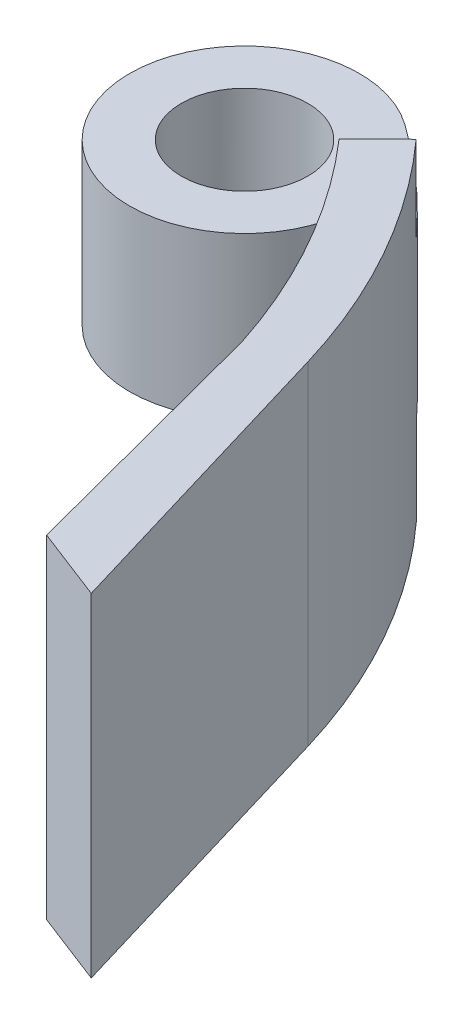
ISO-10303-21;
HEADER;
FILE_DESCRIPTION(('STEP AP214'),'2;1');
FILE_NAME('part.step','',(''),(''),'','','');
FILE_SCHEMA(('AUTOMOTIVE_DESIGN { 1 0 10303 214 1 1 1 1 }'));
ENDSEC;
DATA;
#1=APPLICATION_CONTEXT('core data for automotive mechanical design processes');
#2=APPLICATION_PROTOCOL_DEFINITION('international standard','automotive_design',2000,#1);
#3=PRODUCT_CONTEXT('',#1,'mechanical');
#4=PRODUCT('Part','Part','',(#3));
#5=PRODUCT_RELATED_PRODUCT_CATEGORY('part','',(#4));
#6=PRODUCT_DEFINITION_FORMATION('','',#4);
#7=PRODUCT_DEFINITION_CONTEXT('part definition',#1,'design');
#8=PRODUCT_DEFINITION('design','',#6,#7);
#9=PRODUCT_DEFINITION_SHAPE('','',#8);
#10=(LENGTH_UNIT() NAMED_UNIT(*) SI_UNIT(.MILLI.,.METRE.));
#11=(NAMED_UNIT(*) PLANE_ANGLE_UNIT() SI_UNIT($,.RADIAN.));
#12=(NAMED_UNIT(*) SI_UNIT($,.STERADIAN.) SOLID_ANGLE_UNIT());
#13=UNCERTAINTY_MEASURE_WITH_UNIT(LENGTH_MEASURE(1.E-05),#10,'distance_accuracy_value','');
#14=(GEOMETRIC_REPRESENTATION_CONTEXT(3) GLOBAL_UNCERTAINTY_ASSIGNED_CONTEXT((#13)) GLOBAL_UNIT_ASSIGNED_CONTEXT((#10,
#11,#12)) REPRESENTATION_CONTEXT('',''));
#15=CARTESIAN_POINT('',(0.,0.,0.));
#16=DIRECTION('',(0.,0.,1.));
#17=DIRECTION('',(1.,0.,0.));
#18=AXIS2_PLACEMENT_3D('',#15,#16,#17);
#19=CARTESIAN_POINT('',(23.0206722128998,29.,-62.7690123091901));
#20=DIRECTION('',(0.,-1.,0.));
#21=DIRECTION('',(0.,0.,-1.));
#22=AXIS2_PLACEMENT_3D('',#19,#20,#21);
#23=CYLINDRICAL_SURFACE('',#22,10.);
#24=CARTESIAN_POINT('',(23.0206722128998,21.5,-62.7690123091901));
#25=DIRECTION('',(0.,1.,0.));
#26=DIRECTION('',(0.,0.,1.));
#27=AXIS2_PLACEMENT_3D('',#24,#25,#26);
#28=CIRCLE('',#27,10.);
#29=CARTESIAN_POINT('',(28.818508763389,21.5,-70.9167169757703));
#30=VERTEX_POINT('',#29);
#31=CARTESIAN_POINT('',(32.9081332083161,21.5,-61.2729791998901));
#32=VERTEX_POINT('',#31);
#33=EDGE_CURVE('E250',#30,#32,#28,.T.);
#34=ORIENTED_EDGE('',*,*,#33,.F.);
#35=DIRECTION('',(0.,-1.,0.));
#36=VECTOR('',#35,1.);
#37=CARTESIAN_POINT('',(28.818508763389,29.,-70.9167169757702));
#38=LINE('',#37,#36);
#39=CARTESIAN_POINT('',(28.818508763389,7.5,-70.9167169757703));
#40=VERTEX_POINT('',#39);
#41=EDGE_CURVE('E191',#30,#40,#38,.T.);
#42=ORIENTED_EDGE('',*,*,#41,.T.);
#43=CARTESIAN_POINT('',(23.0206722128998,7.5,-62.7690123091901));
#44=DIRECTION('',(0.,-1.,0.));
#45=DIRECTION('',(0.,0.,-1.));
#46=AXIS2_PLACEMENT_3D('',#43,#44,#45);
#47=CIRCLE('',#46,10.);
#48=CARTESIAN_POINT('',(32.9081332083161,7.5,-61.2729791998901));
#49=VERTEX_POINT('',#48);
#50=EDGE_CURVE('E226',#49,#40,#47,.T.);
#51=ORIENTED_EDGE('',*,*,#50,.F.);
#52=DIRECTION('',(0.,-1.,0.));
#53=VECTOR('',#52,1.);
#54=CARTESIAN_POINT('',(32.9081332083161,29.,-61.2729791998901));
#55=LINE('',#54,#53);
#56=EDGE_CURVE('E180',#32,#49,#55,.T.);
#57=ORIENTED_EDGE('',*,*,#56,.F.);
#58=EDGE_LOOP('',(#34,#42,#51,#57));
#59=FACE_BOUND('',#58,.T.);
#60=ADVANCED_FACE('F36',(#59),#23,.T.);
#61=CARTESIAN_POINT('',(23.0206722128998,29.,-62.7690123091901));
#62=DIRECTION('',(0.,-1.,0.));
#63=DIRECTION('',(0.,0.,-1.));
#64=AXIS2_PLACEMENT_3D('',#61,#62,#63);
#65=CYLINDRICAL_SURFACE('',#64,5.50000000000001);
#66=CARTESIAN_POINT('',(23.0206722128998,7.5,-62.7690123091901));
#67=DIRECTION('',(0.,-1.,0.));
#68=DIRECTION('',(0.,0.,-1.));
#69=AXIS2_PLACEMENT_3D('',#66,#67,#68);
#70=CIRCLE('',#69,5.50000000000001);
#71=CARTESIAN_POINT('',(23.0206722128998,7.5,-68.2690123091901));
#72=VERTEX_POINT('',#71);
#73=EDGE_CURVE('E209',#72,#72,#70,.T.);
#74=ORIENTED_EDGE('',*,*,#73,.T.);
#75=EDGE_LOOP('',(#74));
#76=FACE_BOUND('',#75,.T.);
#77=CARTESIAN_POINT('',(23.0206722128998,21.5,-62.7690123091901));
#78=DIRECTION('',(0.,1.,0.));
#79=DIRECTION('',(0.,0.,1.));
#80=AXIS2_PLACEMENT_3D('',#77,#78,#79);
#81=CIRCLE('',#80,5.50000000000001);
#82=CARTESIAN_POINT('',(23.0206722128998,21.5,-57.2690123091901));
#83=VERTEX_POINT('',#82);
#84=EDGE_CURVE('E244',#83,#83,#81,.T.);
#85=ORIENTED_EDGE('',*,*,#84,.T.);
#86=EDGE_LOOP('',(#85));
#87=FACE_BOUND('',#86,.T.);
#88=ADVANCED_FACE('F38',(#76,#87),#65,.F.);
#89=CARTESIAN_POINT('',(-7.61734022617568,29.,-22.6247450499297));
#90=DIRECTION('',(0.,-1.,0.));
#91=DIRECTION('',(0.,0.,-1.));
#92=AXIS2_PLACEMENT_3D('',#89,#90,#91);
#93=CYLINDRICAL_SURFACE('',#92,55.9999999999987);
#94=DIRECTION('',(0.,-1.,0.));
#95=VECTOR('',#94,1.);
#96=CARTESIAN_POINT('',(34.5803688752672,29.,-59.4398689338699));
#97=LINE('',#96,#95);
#98=CARTESIAN_POINT('',(34.5803688752672,21.5,-59.4398689338699));
#99=VERTEX_POINT('',#98);
#100=CARTESIAN_POINT('',(34.5803688752672,29.,-59.4398689338699));
#101=VERTEX_POINT('',#100);
#102=EDGE_CURVE('E252',#99,#101,#97,.F.);
#103=ORIENTED_EDGE('',*,*,#102,.F.);
#104=CARTESIAN_POINT('',(-7.61734022617568,21.5,-22.6247450499297));
#105=DIRECTION('',(0.,1.,0.));
#106=DIRECTION('',(0.,0.,1.));
#107=AXIS2_PLACEMENT_3D('',#104,#105,#106);
#108=CIRCLE('',#107,55.9999999999987);
#109=EDGE_CURVE('E247',#99,#32,#108,.T.);
#110=ORIENTED_EDGE('',*,*,#109,.T.);
#111=ORIENTED_EDGE('',*,*,#56,.T.);
#112=CARTESIAN_POINT('',(-7.61734022617568,7.5,-22.6247450499297));
#113=DIRECTION('',(0.,-1.,0.));
#114=DIRECTION('',(0.,0.,-1.));
#115=AXIS2_PLACEMENT_3D('',#112,#113,#114);
#116=CIRCLE('',#115,55.9999999999987);
#117=CARTESIAN_POINT('',(34.5572435419437,7.5,-59.4663585323186));
#118=VERTEX_POINT('',#117);
#119=EDGE_CURVE('E223',#49,#118,#116,.T.);
#120=ORIENTED_EDGE('',*,*,#119,.T.);
#121=DIRECTION('',(0.,1.,0.));
#122=VECTOR('',#121,1.);
#123=CARTESIAN_POINT('',(34.5572435419437,3.75,-59.4663585323187));
#124=LINE('',#123,#122);
#125=CARTESIAN_POINT('',(34.5572435419437,0.,-59.4663585323187));
#126=VERTEX_POINT('',#125);
#127=EDGE_CURVE('E231',#118,#126,#124,.F.);
#128=ORIENTED_EDGE('',*,*,#127,.T.);
#129=CARTESIAN_POINT('',(-7.61734022617568,0.,-22.6247450499297));
#130=DIRECTION('',(0.,1.,0.));
#131=DIRECTION('',(0.,0.,1.));
#132=AXIS2_PLACEMENT_3D('',#129,#130,#131);
#133=CIRCLE('',#132,55.9999999999987);
#134=CARTESIAN_POINT('',(45.618872447791,0.,-40.0001777102133));
#135=VERTEX_POINT('',#134);
#136=EDGE_CURVE('E206',#135,#126,#133,.T.);
#137=ORIENTED_EDGE('',*,*,#136,.F.);
#138=DIRECTION('',(0.,-1.,0.));
#139=VECTOR('',#138,1.);
#140=CARTESIAN_POINT('',(45.618872447791,29.,-40.0001777102133));
#141=LINE('',#140,#139);
#142=CARTESIAN_POINT('',(45.618872447791,29.,-40.0001777102133));
#143=VERTEX_POINT('',#142);
#144=EDGE_CURVE('E182',#143,#135,#141,.T.);
#145=ORIENTED_EDGE('',*,*,#144,.F.);
#146=CARTESIAN_POINT('',(-7.61734022617568,29.,-22.6247450499297));
#147=DIRECTION('',(0.,1.,0.));
#148=DIRECTION('',(0.,0.,1.));
#149=AXIS2_PLACEMENT_3D('',#146,#147,#148);
#150=CIRCLE('',#149,55.9999999999987);
#151=EDGE_CURVE('E197',#143,#101,#150,.T.);
#152=ORIENTED_EDGE('',*,*,#151,.T.);
#153=EDGE_LOOP('',(#103,#110,#111,#120,#128,#137,#145,#152));
#154=FACE_BOUND('',#153,.T.);
#155=ADVANCED_FACE('F291',(#154),#93,.F.);
#156=CARTESIAN_POINT('',(-3.64937591935032,29.,-25.2895708429214));
#157=DIRECTION('',(0.,-1.,0.));
#158=DIRECTION('',(0.,0.,-1.));
#159=AXIS2_PLACEMENT_3D('',#156,#157,#158);
#160=CYLINDRICAL_SURFACE('',#159,56.);
#161=CARTESIAN_POINT('',(-3.64937591935032,21.5,-25.2895708429214));
#162=DIRECTION('',(0.,1.,0.));
#163=DIRECTION('',(0.,0.,1.));
#164=AXIS2_PLACEMENT_3D('',#161,#162,#163);
#165=CIRCLE('',#164,56.);
#166=CARTESIAN_POINT('',(37.9537137343731,21.5,-62.7753405597654));
#167=VERTEX_POINT('',#166);
#168=EDGE_CURVE('E170',#167,#30,#165,.T.);
#169=ORIENTED_EDGE('',*,*,#168,.F.);
#170=DIRECTION('',(0.,-1.,0.));
#171=VECTOR('',#170,1.);
#172=CARTESIAN_POINT('',(37.9537137343731,29.,-62.7753405597654));
#173=LINE('',#172,#171);
#174=CARTESIAN_POINT('',(37.9537137343731,29.,-62.7753405597654));
#175=VERTEX_POINT('',#174);
#176=EDGE_CURVE('E254',#167,#175,#173,.F.);
#177=ORIENTED_EDGE('',*,*,#176,.T.);
#178=CARTESIAN_POINT('',(-3.64937591935032,29.,-25.2895708429214));
#179=DIRECTION('',(0.,1.,0.));
#180=DIRECTION('',(0.,0.,1.));
#181=AXIS2_PLACEMENT_3D('',#178,#179,#180);
#182=CIRCLE('',#181,56.);
#183=CARTESIAN_POINT('',(50.0097940460506,29.,-41.3112273934852));
#184=VERTEX_POINT('',#183);
#185=EDGE_CURVE('E193',#184,#175,#182,.T.);
#186=ORIENTED_EDGE('',*,*,#185,.F.);
#187=DIRECTION('',(0.,-1.,0.));
#188=VECTOR('',#187,1.);
#189=CARTESIAN_POINT('',(50.0097940460506,29.,-41.3112273934852));
#190=LINE('',#189,#188);
#191=CARTESIAN_POINT('',(50.0097940460506,0.,-41.3112273934852));
#192=VERTEX_POINT('',#191);
#193=EDGE_CURVE('E189',#184,#192,#190,.T.);
#194=ORIENTED_EDGE('',*,*,#193,.T.);
#195=CARTESIAN_POINT('',(-3.64937591935032,0.,-25.2895708429214));
#196=DIRECTION('',(0.,1.,0.));
#197=DIRECTION('',(0.,0.,1.));
#198=AXIS2_PLACEMENT_3D('',#195,#196,#197);
#199=CIRCLE('',#198,56.);
#200=CARTESIAN_POINT('',(37.8088421101298,0.,-62.9355023338554));
#201=VERTEX_POINT('',#200);
#202=EDGE_CURVE('E194',#192,#201,#199,.T.);
#203=ORIENTED_EDGE('',*,*,#202,.T.);
#204=DIRECTION('',(0.,-1.,0.));
#205=VECTOR('',#204,1.);
#206=CARTESIAN_POINT('',(37.8088421101298,29.,-62.9355023338554));
#207=LINE('',#206,#205);
#208=CARTESIAN_POINT('',(37.8088421101298,7.5,-62.9355023338554));
#209=VERTEX_POINT('',#208);
#210=EDGE_CURVE('E229',#209,#201,#207,.T.);
#211=ORIENTED_EDGE('',*,*,#210,.F.);
#212=CARTESIAN_POINT('',(-3.64937591935032,7.5,-25.2895708429214));
#213=DIRECTION('',(0.,-1.,0.));
#214=DIRECTION('',(0.,0.,-1.));
#215=AXIS2_PLACEMENT_3D('',#212,#213,#214);
#216=CIRCLE('',#215,56.);
#217=EDGE_CURVE('E175',#40,#209,#216,.T.);
#218=ORIENTED_EDGE('',*,*,#217,.F.);
#219=ORIENTED_EDGE('',*,*,#41,.F.);
#220=EDGE_LOOP('',(#169,#177,#186,#194,#203,#211,#218,#219));
#221=FACE_BOUND('',#220,.T.);
#222=ADVANCED_FACE('F303',(#221),#160,.T.);
#223=CARTESIAN_POINT('',(0.,0.,0.));
#224=DIRECTION('',(0.,1.,0.));
#225=DIRECTION('',(0.,0.,1.));
#226=AXIS2_PLACEMENT_3D('',#223,#224,#225);
#227=PLANE('',#226);
#228=DIRECTION('',(-0.695407063160365,0.,0.718616042477953));
#229=VECTOR('',#228,1.);
#230=CARTESIAN_POINT('',(-11.9259738819197,0.,-11.5408034086679));
#231=LINE('',#230,#229);
#232=CARTESIAN_POINT('',(34.6000094366955,0.,-59.6195759377705));
#233=VERTEX_POINT('',#232);
#234=EDGE_CURVE('E177',#201,#233,#231,.T.);
#235=ORIENTED_EDGE('',*,*,#234,.F.);
#236=ORIENTED_EDGE('',*,*,#202,.F.);
#237=DIRECTION('',(0.286101009831496,0.,0.958199463667872));
#238=VECTOR('',#237,1.);
#239=CARTESIAN_POINT('',(57.2414386246392,0.,-17.0912571084399));
#240=LINE('',#239,#238);
#241=CARTESIAN_POINT('',(58.0453486153183,0.,-14.3988299745418));
#242=VERTEX_POINT('',#241);
#243=EDGE_CURVE('E198',#192,#242,#240,.T.);
#244=ORIENTED_EDGE('',*,*,#243,.T.);
#245=DIRECTION('',(0.932682556359361,0.,0.360698279817035));
#246=VECTOR('',#245,1.);
#247=CARTESIAN_POINT('',(12.3958995405945,0.,-32.0529370912444));
#248=LINE('',#247,#246);
#249=CARTESIAN_POINT('',(51.7108084269692,0.,-16.8485999780552));
#250=VERTEX_POINT('',#249);
#251=EDGE_CURVE('E201',#250,#242,#248,.T.);
#252=ORIENTED_EDGE('',*,*,#251,.F.);
#253=DIRECTION('',(0.254470465885758,0.,0.967080545762288));
#254=VECTOR('',#253,1.);
#255=CARTESIAN_POINT('',(52.5085936316344,0.,-13.816725342061));
#256=LINE('',#255,#254);
#257=EDGE_CURVE('E204',#135,#250,#256,.T.);
#258=ORIENTED_EDGE('',*,*,#257,.F.);
#259=ORIENTED_EDGE('',*,*,#136,.T.);
#260=CARTESIAN_POINT('',(23.0206722128998,0.,-62.7690123091901));
#261=DIRECTION('',(0.,-1.,0.));
#262=DIRECTION('',(0.,0.,-1.));
#263=AXIS2_PLACEMENT_3D('',#260,#261,#262);
#264=CIRCLE('',#263,12.);
#265=EDGE_CURVE('E237',#233,#126,#264,.T.);
#266=ORIENTED_EDGE('',*,*,#265,.F.);
#267=EDGE_LOOP('',(#235,#236,#244,#252,#258,#259,#266));
#268=FACE_BOUND('',#267,.T.);
#269=ADVANCED_FACE('F267',(#268),#227,.F.);
#270=CARTESIAN_POINT('',(52.5085936316344,29.,-13.816725342061));
#271=DIRECTION('',(0.967080545762288,0.,-0.254470465885758));
#272=DIRECTION('',(-0.254470465885758,0.,-0.967080545762288));
#273=AXIS2_PLACEMENT_3D('',#270,#271,#272);
#274=PLANE('',#273);
#275=DIRECTION('',(0.254470465885758,0.,0.967080545762288));
#276=VECTOR('',#275,1.);
#277=CARTESIAN_POINT('',(52.5085936316344,13.5,-13.816725342061));
#278=LINE('',#277,#276);
#279=CARTESIAN_POINT('',(47.600223815655,13.5,-32.470320146935));
#280=VERTEX_POINT('',#279);
#281=CARTESIAN_POINT('',(48.1093326274519,13.5,-30.5355210501081));
#282=VERTEX_POINT('',#281);
#283=EDGE_CURVE('E44',#280,#282,#278,.T.);
#284=ORIENTED_EDGE('',*,*,#283,.F.);
#285=DIRECTION('',(0.,1.,0.));
#286=VECTOR('',#285,1.);
#287=CARTESIAN_POINT('',(47.600223815655,13.5,-32.470320146935));
#288=LINE('',#287,#286);
#289=CARTESIAN_POINT('',(47.600223815655,15.5,-32.470320146935));
#290=VERTEX_POINT('',#289);
#291=EDGE_CURVE('E11',#280,#290,#288,.T.);
#292=ORIENTED_EDGE('',*,*,#291,.T.);
#293=DIRECTION('',(0.254470465885758,0.,0.967080545762288));
#294=VECTOR('',#293,1.);
#295=CARTESIAN_POINT('',(52.5085936316344,15.5,-13.816725342061));
#296=LINE('',#295,#294);
#297=CARTESIAN_POINT('',(48.1093326274519,15.5,-30.5355210501081));
#298=VERTEX_POINT('',#297);
#299=EDGE_CURVE('E140',#290,#298,#296,.T.);
#300=ORIENTED_EDGE('',*,*,#299,.T.);
#301=DIRECTION('',(0.,1.,0.));
#302=VECTOR('',#301,1.);
#303=CARTESIAN_POINT('',(48.1093326274519,13.5,-30.5355210501081));
#304=LINE('',#303,#302);
#305=EDGE_CURVE('E144',#282,#298,#304,.T.);
#306=ORIENTED_EDGE('',*,*,#305,.F.);
#307=EDGE_LOOP('',(#284,#292,#300,#306));
#308=FACE_BOUND('',#307,.T.);
#309=CARTESIAN_POINT('',(49.1265431369703,15.5,-26.6697502571161));
#310=VERTEX_POINT('',#309);
#311=CARTESIAN_POINT('',(49.6356519487672,15.5,-24.7349511602892));
#312=VERTEX_POINT('',#311);
#313=EDGE_CURVE('E147',#310,#312,#296,.T.);
#314=ORIENTED_EDGE('',*,*,#313,.T.);
#315=DIRECTION('',(0.,1.,0.));
#316=VECTOR('',#315,1.);
#317=CARTESIAN_POINT('',(49.6356519487672,13.5,-24.7349511602892));
#318=LINE('',#317,#316);
#319=CARTESIAN_POINT('',(49.6356519487672,13.5,-24.7349511602892));
#320=VERTEX_POINT('',#319);
#321=EDGE_CURVE('E145',#312,#320,#318,.F.);
#322=ORIENTED_EDGE('',*,*,#321,.T.);
#323=CARTESIAN_POINT('',(49.1265431369703,13.5,-26.6697502571161));
#324=VERTEX_POINT('',#323);
#325=EDGE_CURVE('E163',#324,#320,#278,.T.);
#326=ORIENTED_EDGE('',*,*,#325,.F.);
#327=DIRECTION('',(0.,1.,0.));
#328=VECTOR('',#327,1.);
#329=CARTESIAN_POINT('',(49.1265431369703,13.5,-26.6697502571161));
#330=LINE('',#329,#328);
#331=EDGE_CURVE('E166',#310,#324,#330,.F.);
#332=ORIENTED_EDGE('',*,*,#331,.F.);
#333=EDGE_LOOP('',(#314,#322,#326,#332));
#334=FACE_BOUND('',#333,.T.);
#335=ORIENTED_EDGE('',*,*,#257,.T.);
#336=DIRECTION('',(0.,-1.,0.));
#337=VECTOR('',#336,1.);
#338=CARTESIAN_POINT('',(51.7108084269692,29.,-16.8485999780552));
#339=LINE('',#338,#337);
#340=CARTESIAN_POINT('',(51.7108084269692,29.,-16.8485999780552));
#341=VERTEX_POINT('',#340);
#342=EDGE_CURVE('E184',#341,#250,#339,.T.);
#343=ORIENTED_EDGE('',*,*,#342,.F.);
#344=DIRECTION('',(0.254470465885758,0.,0.967080545762288));
#345=VECTOR('',#344,1.);
#346=CARTESIAN_POINT('',(52.5085936316344,29.,-13.816725342061));
#347=LINE('',#346,#345);
#348=EDGE_CURVE('E217',#143,#341,#347,.T.);
#349=ORIENTED_EDGE('',*,*,#348,.F.);
#350=ORIENTED_EDGE('',*,*,#144,.T.);
#351=EDGE_LOOP('',(#335,#343,#349,#350));
#352=FACE_BOUND('',#351,.T.);
#353=ADVANCED_FACE('F157',(#308,#334,#352),#274,.F.);
#354=CARTESIAN_POINT('',(12.3958995405945,29.,-32.0529370912444));
#355=DIRECTION('',(0.360698279817035,0.,-0.932682556359361));
#356=DIRECTION('',(-0.932682556359361,0.,-0.360698279817035));
#357=AXIS2_PLACEMENT_3D('',#354,#355,#356);
#358=PLANE('',#357);
#359=ORIENTED_EDGE('',*,*,#251,.T.);
#360=DIRECTION('',(0.,-1.,0.));
#361=VECTOR('',#360,1.);
#362=CARTESIAN_POINT('',(58.0453486153183,29.,-14.3988299745418));
#363=LINE('',#362,#361);
#364=CARTESIAN_POINT('',(58.0453486153183,29.,-14.3988299745418));
#365=VERTEX_POINT('',#364);
#366=EDGE_CURVE('E187',#365,#242,#363,.T.);
#367=ORIENTED_EDGE('',*,*,#366,.F.);
#368=DIRECTION('',(0.932682556359361,0.,0.360698279817035));
#369=VECTOR('',#368,1.);
#370=CARTESIAN_POINT('',(12.3958995405945,29.,-32.0529370912444));
#371=LINE('',#370,#369);
#372=EDGE_CURVE('E215',#341,#365,#371,.T.);
#373=ORIENTED_EDGE('',*,*,#372,.F.);
#374=ORIENTED_EDGE('',*,*,#342,.T.);
#375=EDGE_LOOP('',(#359,#367,#373,#374));
#376=FACE_BOUND('',#375,.T.);
#377=ADVANCED_FACE('F266',(#376),#358,.F.);
#378=CARTESIAN_POINT('',(57.2414386246392,29.,-17.0912571084399));
#379=DIRECTION('',(0.958199463667872,0.,-0.286101009831496));
#380=DIRECTION('',(-0.286101009831496,0.,-0.958199463667872));
#381=AXIS2_PLACEMENT_3D('',#378,#379,#380);
#382=PLANE('',#381);
#383=ORIENTED_EDGE('',*,*,#243,.F.);
#384=ORIENTED_EDGE('',*,*,#193,.F.);
#385=DIRECTION('',(0.286101009831496,0.,0.958199463667872));
#386=VECTOR('',#385,1.);
#387=CARTESIAN_POINT('',(57.2414386246392,29.,-17.0912571084399));
#388=LINE('',#387,#386);
#389=EDGE_CURVE('E212',#184,#365,#388,.T.);
#390=ORIENTED_EDGE('',*,*,#389,.T.);
#391=ORIENTED_EDGE('',*,*,#366,.T.);
#392=EDGE_LOOP('',(#383,#384,#390,#391));
#393=FACE_BOUND('',#392,.T.);
#394=ADVANCED_FACE('F282',(#393),#382,.T.);
#395=CARTESIAN_POINT('',(0.,29.,0.));
#396=DIRECTION('',(0.,1.,0.));
#397=DIRECTION('',(0.,0.,1.));
#398=AXIS2_PLACEMENT_3D('',#395,#396,#397);
#399=PLANE('',#398);
#400=DIRECTION('',(0.7110872751399,0.,-0.703103752752119));
#401=VECTOR('',#400,1.);
#402=CARTESIAN_POINT('',(-12.623065866088,29.,-12.7663968162499));
#403=LINE('',#402,#401);
#404=EDGE_CURVE('E173',#101,#175,#403,.T.);
#405=ORIENTED_EDGE('',*,*,#404,.F.);
#406=ORIENTED_EDGE('',*,*,#151,.F.);
#407=ORIENTED_EDGE('',*,*,#348,.T.);
#408=ORIENTED_EDGE('',*,*,#372,.T.);
#409=ORIENTED_EDGE('',*,*,#389,.F.);
#410=ORIENTED_EDGE('',*,*,#185,.T.);
#411=EDGE_LOOP('',(#405,#406,#407,#408,#409,#410));
#412=FACE_BOUND('',#411,.T.);
#413=ADVANCED_FACE('F287',(#412),#399,.T.);
#414=CARTESIAN_POINT('',(-11.9259738819197,0.,-11.5408034086679));
#415=DIRECTION('',(-0.718616042477953,0.,-0.695407063160365));
#416=DIRECTION('',(-0.695407063160365,0.,0.718616042477953));
#417=AXIS2_PLACEMENT_3D('',#414,#415,#416);
#418=PLANE('',#417);
#419=ORIENTED_EDGE('',*,*,#210,.T.);
#420=ORIENTED_EDGE('',*,*,#234,.T.);
#421=DIRECTION('',(0.,1.,0.));
#422=VECTOR('',#421,1.);
#423=CARTESIAN_POINT('',(34.6000094366955,0.,-59.6195759377705));
#424=LINE('',#423,#422);
#425=CARTESIAN_POINT('',(34.6000094366955,7.5,-59.6195759377705));
#426=VERTEX_POINT('',#425);
#427=EDGE_CURVE('E234',#233,#426,#424,.T.);
#428=ORIENTED_EDGE('',*,*,#427,.T.);
#429=DIRECTION('',(-0.695407063160365,0.,0.718616042477953));
#430=VECTOR('',#429,1.);
#431=CARTESIAN_POINT('',(-11.9259738819197,7.5,-11.5408034086679));
#432=LINE('',#431,#430);
#433=EDGE_CURVE('E242',#209,#426,#432,.T.);
#434=ORIENTED_EDGE('',*,*,#433,.F.);
#435=EDGE_LOOP('',(#419,#420,#428,#434));
#436=FACE_BOUND('',#435,.T.);
#437=ADVANCED_FACE('F298',(#436),#418,.T.);
#438=CARTESIAN_POINT('',(23.0206722128998,0.,-62.7690123091901));
#439=DIRECTION('',(0.,1.,0.));
#440=DIRECTION('',(0.,0.,1.));
#441=AXIS2_PLACEMENT_3D('',#438,#439,#440);
#442=CYLINDRICAL_SURFACE('',#441,12.);
#443=CARTESIAN_POINT('',(23.0206722128998,7.5,-62.7690123091901));
#444=DIRECTION('',(0.,-1.,0.));
#445=DIRECTION('',(0.,0.,-1.));
#446=AXIS2_PLACEMENT_3D('',#443,#444,#445);
#447=CIRCLE('',#446,12.);
#448=EDGE_CURVE('E239',#426,#118,#447,.T.);
#449=ORIENTED_EDGE('',*,*,#448,.F.);
#450=ORIENTED_EDGE('',*,*,#427,.F.);
#451=ORIENTED_EDGE('',*,*,#265,.T.);
#452=ORIENTED_EDGE('',*,*,#127,.F.);
#453=EDGE_LOOP('',(#449,#450,#451,#452));
#454=FACE_BOUND('',#453,.T.);
#455=ADVANCED_FACE('F295',(#454),#442,.F.);
#456=CARTESIAN_POINT('',(0.,7.5,0.));
#457=DIRECTION('',(0.,-1.,0.));
#458=DIRECTION('',(0.,0.,-1.));
#459=AXIS2_PLACEMENT_3D('',#456,#457,#458);
#460=PLANE('',#459);
#461=ORIENTED_EDGE('',*,*,#73,.F.);
#462=EDGE_LOOP('',(#461));
#463=FACE_BOUND('',#462,.T.);
#464=ORIENTED_EDGE('',*,*,#50,.T.);
#465=ORIENTED_EDGE('',*,*,#217,.T.);
#466=ORIENTED_EDGE('',*,*,#433,.T.);
#467=ORIENTED_EDGE('',*,*,#448,.T.);
#468=ORIENTED_EDGE('',*,*,#119,.F.);
#469=EDGE_LOOP('',(#464,#465,#466,#467,#468));
#470=FACE_BOUND('',#469,.T.);
#471=ADVANCED_FACE('F316',(#463,#470),#460,.T.);
#472=CARTESIAN_POINT('',(-12.623065866088,29.,-12.7663968162499));
#473=DIRECTION('',(0.703103752752119,0.,0.7110872751399));
#474=DIRECTION('',(0.7110872751399,0.,-0.703103752752119));
#475=AXIS2_PLACEMENT_3D('',#472,#473,#474);
#476=PLANE('',#475);
#477=ORIENTED_EDGE('',*,*,#102,.T.);
#478=ORIENTED_EDGE('',*,*,#404,.T.);
#479=ORIENTED_EDGE('',*,*,#176,.F.);
#480=DIRECTION('',(-0.7110872751399,0.,0.703103752752119));
#481=VECTOR('',#480,1.);
#482=CARTESIAN_POINT('',(-12.623065866088,21.5,-12.7663968162499));
#483=LINE('',#482,#481);
#484=EDGE_CURVE('E257',#167,#99,#483,.T.);
#485=ORIENTED_EDGE('',*,*,#484,.T.);
#486=EDGE_LOOP('',(#477,#478,#479,#485));
#487=FACE_BOUND('',#486,.T.);
#488=ADVANCED_FACE('F307',(#487),#476,.F.);
#489=CARTESIAN_POINT('',(0.,21.5,0.));
#490=DIRECTION('',(0.,1.,0.));
#491=DIRECTION('',(0.,0.,1.));
#492=AXIS2_PLACEMENT_3D('',#489,#490,#491);
#493=PLANE('',#492);
#494=ORIENTED_EDGE('',*,*,#84,.F.);
#495=EDGE_LOOP('',(#494));
#496=FACE_BOUND('',#495,.T.);
#497=ORIENTED_EDGE('',*,*,#484,.F.);
#498=ORIENTED_EDGE('',*,*,#168,.T.);
#499=ORIENTED_EDGE('',*,*,#33,.T.);
#500=ORIENTED_EDGE('',*,*,#109,.F.);
#501=EDGE_LOOP('',(#497,#498,#499,#500));
#502=FACE_BOUND('',#501,.T.);
#503=ADVANCED_FACE('F309',(#496,#502),#493,.T.);
#504=CARTESIAN_POINT('',(48.6881744252636,13.5,-28.6211171812482));
#505=DIRECTION('',(0.,1.,0.));
#506=DIRECTION('',(0.,0.,1.));
#507=AXIS2_PLACEMENT_3D('',#504,#505,#506);
#508=CYLINDRICAL_SURFACE('',#507,4.00000000000001);
#509=ORIENTED_EDGE('',*,*,#291,.F.);
#510=CARTESIAN_POINT('',(48.6881744252636,13.5,-28.6211171812482));
#511=DIRECTION('',(0.,1.,0.));
#512=DIRECTION('',(0.,0.,1.));
#513=AXIS2_PLACEMENT_3D('',#510,#511,#512);
#514=CIRCLE('',#513,4.00000000000001);
#515=EDGE_CURVE('E260',#280,#320,#514,.T.);
#516=ORIENTED_EDGE('',*,*,#515,.T.);
#517=ORIENTED_EDGE('',*,*,#321,.F.);
#518=CARTESIAN_POINT('',(48.6881744252636,15.5,-28.6211171812482));
#519=DIRECTION('',(0.,1.,0.));
#520=DIRECTION('',(0.,0.,1.));
#521=AXIS2_PLACEMENT_3D('',#518,#519,#520);
#522=CIRCLE('',#521,4.00000000000001);
#523=EDGE_CURVE('E56',#290,#312,#522,.T.);
#524=ORIENTED_EDGE('',*,*,#523,.F.);
#525=EDGE_LOOP('',(#509,#516,#517,#524));
#526=FACE_BOUND('',#525,.T.);
#527=ADVANCED_FACE('F149',(#526),#508,.T.);
#528=CARTESIAN_POINT('',(48.6881744252636,13.5,-28.6211171812482));
#529=DIRECTION('',(0.,1.,0.));
#530=DIRECTION('',(0.,0.,1.));
#531=AXIS2_PLACEMENT_3D('',#528,#529,#530);
#532=PLANE('',#531);
#533=ORIENTED_EDGE('',*,*,#515,.F.);
#534=ORIENTED_EDGE('',*,*,#283,.T.);
#535=CARTESIAN_POINT('',(48.6881744252636,13.5,-28.6211171812482));
#536=DIRECTION('',(0.,1.,0.));
#537=DIRECTION('',(0.,0.,1.));
#538=AXIS2_PLACEMENT_3D('',#535,#536,#537);
#539=CIRCLE('',#538,2.);
#540=EDGE_CURVE('E154',#282,#324,#539,.T.);
#541=ORIENTED_EDGE('',*,*,#540,.T.);
#542=ORIENTED_EDGE('',*,*,#325,.T.);
#543=EDGE_LOOP('',(#533,#534,#541,#542));
#544=FACE_BOUND('',#543,.T.);
#545=ADVANCED_FACE('F421',(#544),#532,.F.);
#546=CARTESIAN_POINT('',(48.6881744252636,13.5,-28.6211171812482));
#547=DIRECTION('',(0.,1.,0.));
#548=DIRECTION('',(0.,0.,1.));
#549=AXIS2_PLACEMENT_3D('',#546,#547,#548);
#550=CYLINDRICAL_SURFACE('',#549,2.);
#551=ORIENTED_EDGE('',*,*,#540,.F.);
#552=ORIENTED_EDGE('',*,*,#305,.T.);
#553=CARTESIAN_POINT('',(48.6881744252636,15.5,-28.6211171812482));
#554=DIRECTION('',(0.,1.,0.));
#555=DIRECTION('',(0.,0.,1.));
#556=AXIS2_PLACEMENT_3D('',#553,#554,#555);
#557=CIRCLE('',#556,2.);
#558=EDGE_CURVE('E51',#298,#310,#557,.T.);
#559=ORIENTED_EDGE('',*,*,#558,.T.);
#560=ORIENTED_EDGE('',*,*,#331,.T.);
#561=EDGE_LOOP('',(#551,#552,#559,#560));
#562=FACE_BOUND('',#561,.T.);
#563=ADVANCED_FACE('F263',(#562),#550,.F.);
#564=CARTESIAN_POINT('',(48.6881744252636,15.5,-28.6211171812482));
#565=DIRECTION('',(0.,1.,0.));
#566=DIRECTION('',(0.,0.,1.));
#567=AXIS2_PLACEMENT_3D('',#564,#565,#566);
#568=PLANE('',#567);
#569=ORIENTED_EDGE('',*,*,#299,.F.);
#570=ORIENTED_EDGE('',*,*,#523,.T.);
#571=ORIENTED_EDGE('',*,*,#313,.F.);
#572=ORIENTED_EDGE('',*,*,#558,.F.);
#573=EDGE_LOOP('',(#569,#570,#571,#572));
#574=FACE_BOUND('',#573,.T.);
#575=ADVANCED_FACE('F141',(#574),#568,.T.);
#576=CLOSED_SHELL('',(#60,#88,#155,#222,#269,#353,#377,#394,#413,#437,#455,#471,#488,#503,#527,
#545,#563,#575));
#577=MANIFOLD_SOLID_BREP('B2',#576);
#578=ADVANCED_BREP_SHAPE_REPRESENTATION('',(#18,#577),#14);
#579=SHAPE_DEFINITION_REPRESENTATION(#9,#578);
ENDSEC;
END-ISO-10303-21;
